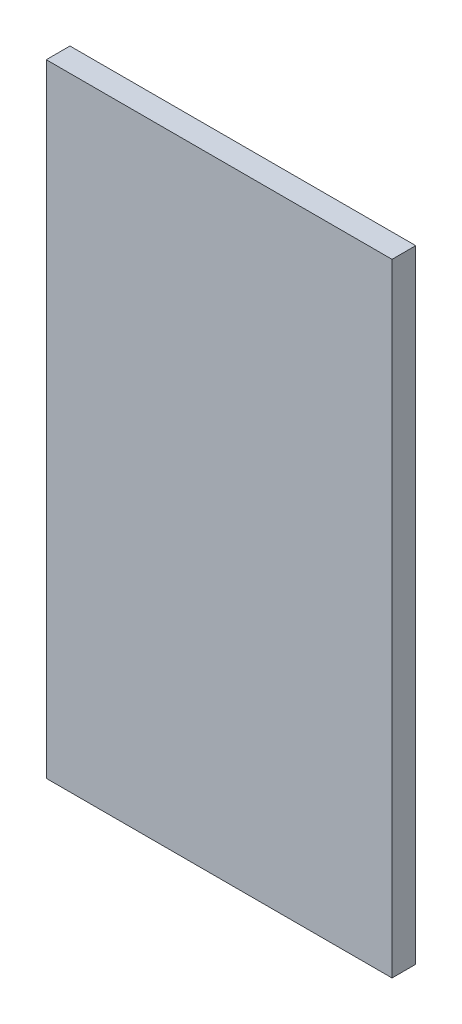
ISO-10303-21;
HEADER;
FILE_DESCRIPTION(('STEP AP214'),'2;1');
FILE_NAME('part.step','',(''),(''),'','','');
FILE_SCHEMA(('AUTOMOTIVE_DESIGN { 1 0 10303 214 1 1 1 1 }'));
ENDSEC;
DATA;
#1=APPLICATION_CONTEXT('core data for automotive mechanical design processes');
#2=APPLICATION_PROTOCOL_DEFINITION('international standard','automotive_design',2000,#1);
#3=PRODUCT_CONTEXT('',#1,'mechanical');
#4=PRODUCT('Part','Part','',(#3));
#5=PRODUCT_RELATED_PRODUCT_CATEGORY('part','',(#4));
#6=PRODUCT_DEFINITION_FORMATION('','',#4);
#7=PRODUCT_DEFINITION_CONTEXT('part definition',#1,'design');
#8=PRODUCT_DEFINITION('design','',#6,#7);
#9=PRODUCT_DEFINITION_SHAPE('','',#8);
#10=(LENGTH_UNIT() NAMED_UNIT(*) SI_UNIT(.MILLI.,.METRE.));
#11=(NAMED_UNIT(*) PLANE_ANGLE_UNIT() SI_UNIT($,.RADIAN.));
#12=(NAMED_UNIT(*) SI_UNIT($,.STERADIAN.) SOLID_ANGLE_UNIT());
#13=UNCERTAINTY_MEASURE_WITH_UNIT(LENGTH_MEASURE(1.E-05),#10,'distance_accuracy_value','');
#14=(GEOMETRIC_REPRESENTATION_CONTEXT(3) GLOBAL_UNCERTAINTY_ASSIGNED_CONTEXT((#13)) GLOBAL_UNIT_ASSIGNED_CONTEXT((#10,
#11,#12)) REPRESENTATION_CONTEXT('',''));
#15=CARTESIAN_POINT('',(0.,0.,0.));
#16=DIRECTION('',(0.,0.,1.));
#17=DIRECTION('',(1.,0.,0.));
#18=AXIS2_PLACEMENT_3D('',#15,#16,#17);
#19=CARTESIAN_POINT('',(6.60008,0.7,0.));
#20=DIRECTION('',(0.,0.,-1.));
#21=DIRECTION('',(-1.,0.,0.));
#22=AXIS2_PLACEMENT_3D('',#19,#20,#21);
#23=PLANE('',#22);
#24=DIRECTION('',(1.,0.,0.));
#25=VECTOR('',#24,1.);
#26=CARTESIAN_POINT('',(6.35008,1.15,0.));
#27=LINE('',#26,#25);
#28=CARTESIAN_POINT('',(6.35008,1.15,0.));
#29=VERTEX_POINT('',#28);
#30=CARTESIAN_POINT('',(6.85008,1.15,0.));
#31=VERTEX_POINT('',#30);
#32=EDGE_CURVE('E55',#29,#31,#27,.T.);
#33=ORIENTED_EDGE('',*,*,#32,.T.);
#34=DIRECTION('',(0.,1.,0.));
#35=VECTOR('',#34,1.);
#36=CARTESIAN_POINT('',(6.85008,1.15,0.));
#37=LINE('',#36,#35);
#38=CARTESIAN_POINT('',(6.85008,0.25,0.));
#39=VERTEX_POINT('',#38);
#40=EDGE_CURVE('E57',#31,#39,#37,.F.);
#41=ORIENTED_EDGE('',*,*,#40,.T.);
#42=DIRECTION('',(1.,0.,0.));
#43=VECTOR('',#42,1.);
#44=CARTESIAN_POINT('',(6.85008,0.25,0.));
#45=LINE('',#44,#43);
#46=CARTESIAN_POINT('',(6.35008,0.25,0.));
#47=VERTEX_POINT('',#46);
#48=EDGE_CURVE('E20',#39,#47,#45,.F.);
#49=ORIENTED_EDGE('',*,*,#48,.T.);
#50=DIRECTION('',(0.,1.,0.));
#51=VECTOR('',#50,1.);
#52=CARTESIAN_POINT('',(6.35008,0.25,0.));
#53=LINE('',#52,#51);
#54=EDGE_CURVE('E80',#47,#29,#53,.T.);
#55=ORIENTED_EDGE('',*,*,#54,.T.);
#56=EDGE_LOOP('',(#33,#41,#49,#55));
#57=FACE_BOUND('',#56,.T.);
#58=ADVANCED_FACE('F17',(#57),#23,.T.);
#59=CARTESIAN_POINT('',(6.85008,0.25,0.));
#60=DIRECTION('',(0.,1.,0.));
#61=DIRECTION('',(0.,0.,1.));
#62=AXIS2_PLACEMENT_3D('',#59,#60,#61);
#63=PLANE('',#62);
#64=DIRECTION('',(0.,0.,-1.));
#65=VECTOR('',#64,1.);
#66=CARTESIAN_POINT('',(6.35008,0.25,0.));
#67=LINE('',#66,#65);
#68=CARTESIAN_POINT('',(6.35008,0.25,0.03429));
#69=VERTEX_POINT('',#68);
#70=EDGE_CURVE('E68',#69,#47,#67,.T.);
#71=ORIENTED_EDGE('',*,*,#70,.T.);
#72=ORIENTED_EDGE('',*,*,#48,.F.);
#73=DIRECTION('',(0.,0.,1.));
#74=VECTOR('',#73,1.);
#75=CARTESIAN_POINT('',(6.85008,0.25,0.));
#76=LINE('',#75,#74);
#77=CARTESIAN_POINT('',(6.85008,0.25,0.03429));
#78=VERTEX_POINT('',#77);
#79=EDGE_CURVE('E63',#39,#78,#76,.T.);
#80=ORIENTED_EDGE('',*,*,#79,.T.);
#81=DIRECTION('',(1.,0.,0.));
#82=VECTOR('',#81,1.);
#83=CARTESIAN_POINT('',(6.60008,0.25,0.03429));
#84=LINE('',#83,#82);
#85=EDGE_CURVE('E83',#69,#78,#84,.T.);
#86=ORIENTED_EDGE('',*,*,#85,.F.);
#87=EDGE_LOOP('',(#71,#72,#80,#86));
#88=FACE_BOUND('',#87,.T.);
#89=ADVANCED_FACE('F65',(#88),#63,.F.);
#90=CARTESIAN_POINT('',(6.85008,1.15,0.));
#91=DIRECTION('',(-1.,0.,0.));
#92=DIRECTION('',(0.,0.,1.));
#93=AXIS2_PLACEMENT_3D('',#90,#91,#92);
#94=PLANE('',#93);
#95=ORIENTED_EDGE('',*,*,#79,.F.);
#96=ORIENTED_EDGE('',*,*,#40,.F.);
#97=DIRECTION('',(0.,0.,-1.));
#98=VECTOR('',#97,1.);
#99=CARTESIAN_POINT('',(6.85008,1.15,0.));
#100=LINE('',#99,#98);
#101=CARTESIAN_POINT('',(6.85008,1.15,0.03429));
#102=VERTEX_POINT('',#101);
#103=EDGE_CURVE('E75',#31,#102,#100,.F.);
#104=ORIENTED_EDGE('',*,*,#103,.T.);
#105=DIRECTION('',(0.,1.,0.));
#106=VECTOR('',#105,1.);
#107=CARTESIAN_POINT('',(6.85008,0.7,0.03429));
#108=LINE('',#107,#106);
#109=EDGE_CURVE('E72',#78,#102,#108,.T.);
#110=ORIENTED_EDGE('',*,*,#109,.F.);
#111=EDGE_LOOP('',(#95,#96,#104,#110));
#112=FACE_BOUND('',#111,.T.);
#113=ADVANCED_FACE('F70',(#112),#94,.F.);
#114=CARTESIAN_POINT('',(6.35008,1.15,0.));
#115=DIRECTION('',(0.,-1.,0.));
#116=DIRECTION('',(0.,0.,-1.));
#117=AXIS2_PLACEMENT_3D('',#114,#115,#116);
#118=PLANE('',#117);
#119=ORIENTED_EDGE('',*,*,#103,.F.);
#120=ORIENTED_EDGE('',*,*,#32,.F.);
#121=DIRECTION('',(0.,0.,-1.));
#122=VECTOR('',#121,1.);
#123=CARTESIAN_POINT('',(6.35008,1.15,0.));
#124=LINE('',#123,#122);
#125=CARTESIAN_POINT('',(6.35008,1.15,0.03429));
#126=VERTEX_POINT('',#125);
#127=EDGE_CURVE('E35',#29,#126,#124,.F.);
#128=ORIENTED_EDGE('',*,*,#127,.T.);
#129=DIRECTION('',(1.,0.,0.));
#130=VECTOR('',#129,1.);
#131=CARTESIAN_POINT('',(6.60008,1.15,0.03429));
#132=LINE('',#131,#130);
#133=EDGE_CURVE('E26',#102,#126,#132,.F.);
#134=ORIENTED_EDGE('',*,*,#133,.F.);
#135=EDGE_LOOP('',(#119,#120,#128,#134));
#136=FACE_BOUND('',#135,.T.);
#137=ADVANCED_FACE('F89',(#136),#118,.F.);
#138=CARTESIAN_POINT('',(6.35008,0.25,0.));
#139=DIRECTION('',(1.,0.,0.));
#140=DIRECTION('',(0.,0.,-1.));
#141=AXIS2_PLACEMENT_3D('',#138,#139,#140);
#142=PLANE('',#141);
#143=ORIENTED_EDGE('',*,*,#127,.F.);
#144=ORIENTED_EDGE('',*,*,#54,.F.);
#145=ORIENTED_EDGE('',*,*,#70,.F.);
#146=DIRECTION('',(0.,1.,0.));
#147=VECTOR('',#146,1.);
#148=CARTESIAN_POINT('',(6.35008,0.7,0.03429));
#149=LINE('',#148,#147);
#150=EDGE_CURVE('E11',#126,#69,#149,.F.);
#151=ORIENTED_EDGE('',*,*,#150,.F.);
#152=EDGE_LOOP('',(#143,#144,#145,#151));
#153=FACE_BOUND('',#152,.T.);
#154=ADVANCED_FACE('F91',(#153),#142,.F.);
#155=CARTESIAN_POINT('',(6.60008,0.7,0.03429));
#156=DIRECTION('',(0.,0.,1.));
#157=DIRECTION('',(1.,0.,0.));
#158=AXIS2_PLACEMENT_3D('',#155,#156,#157);
#159=PLANE('',#158);
#160=ORIENTED_EDGE('',*,*,#133,.T.);
#161=ORIENTED_EDGE('',*,*,#150,.T.);
#162=ORIENTED_EDGE('',*,*,#85,.T.);
#163=ORIENTED_EDGE('',*,*,#109,.T.);
#164=EDGE_LOOP('',(#160,#161,#162,#163));
#165=FACE_BOUND('',#164,.T.);
#166=ADVANCED_FACE('F88',(#165),#159,.T.);
#167=CLOSED_SHELL('',(#58,#89,#113,#137,#154,#166));
#168=MANIFOLD_SOLID_BREP('B1',#167);
#169=ADVANCED_BREP_SHAPE_REPRESENTATION('',(#18,#168),#14);
#170=SHAPE_DEFINITION_REPRESENTATION(#9,#169);
ENDSEC;
END-ISO-10303-21;
